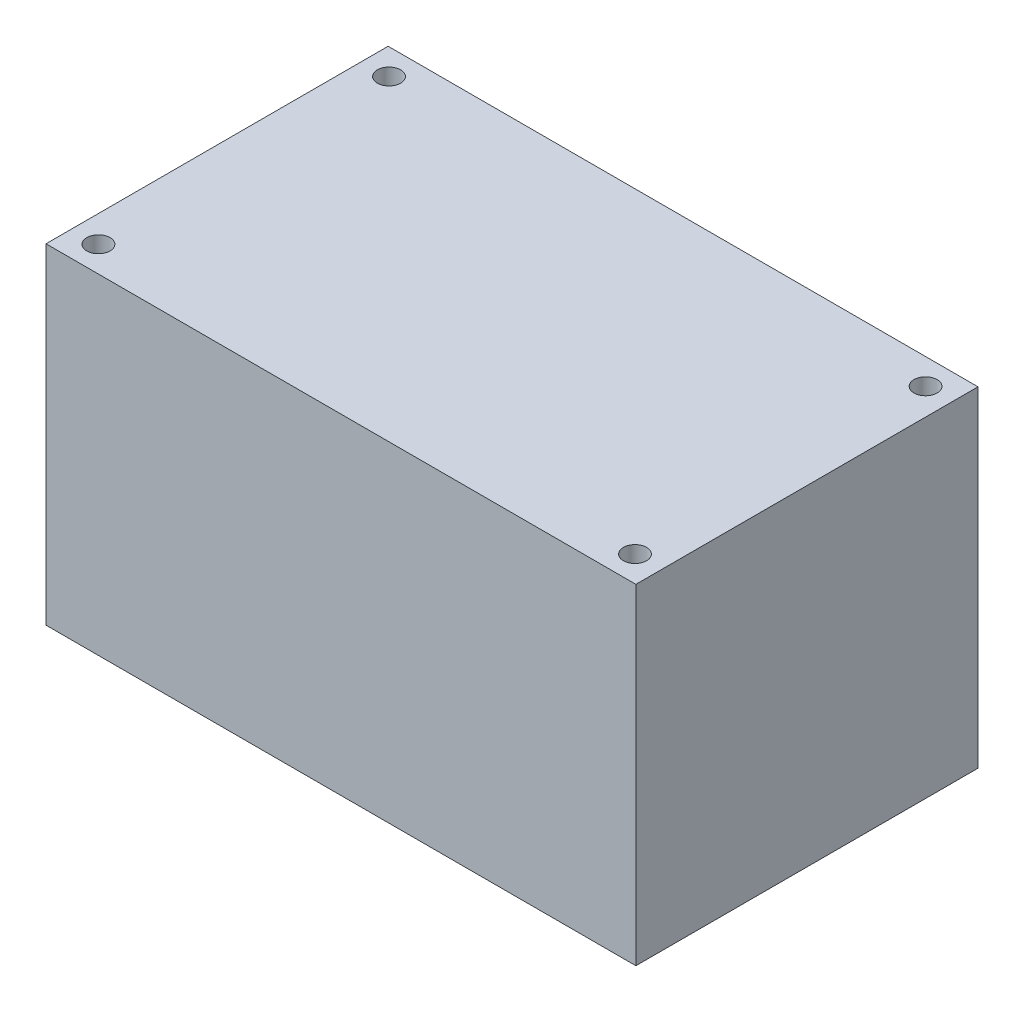
ISO-10303-21;
HEADER;
FILE_DESCRIPTION(('STEP AP214'),'2;1');
FILE_NAME('part.step','',(''),(''),'','','');
FILE_SCHEMA(('AUTOMOTIVE_DESIGN { 1 0 10303 214 1 1 1 1 }'));
ENDSEC;
DATA;
#1=APPLICATION_CONTEXT('core data for automotive mechanical design processes');
#2=APPLICATION_PROTOCOL_DEFINITION('international standard','automotive_design',2000,#1);
#3=PRODUCT_CONTEXT('',#1,'mechanical');
#4=PRODUCT('Part','Part','',(#3));
#5=PRODUCT_RELATED_PRODUCT_CATEGORY('part','',(#4));
#6=PRODUCT_DEFINITION_FORMATION('','',#4);
#7=PRODUCT_DEFINITION_CONTEXT('part definition',#1,'design');
#8=PRODUCT_DEFINITION('design','',#6,#7);
#9=PRODUCT_DEFINITION_SHAPE('','',#8);
#10=(LENGTH_UNIT() NAMED_UNIT(*) SI_UNIT(.MILLI.,.METRE.));
#11=(NAMED_UNIT(*) PLANE_ANGLE_UNIT() SI_UNIT($,.RADIAN.));
#12=(NAMED_UNIT(*) SI_UNIT($,.STERADIAN.) SOLID_ANGLE_UNIT());
#13=UNCERTAINTY_MEASURE_WITH_UNIT(LENGTH_MEASURE(1.E-05),#10,'distance_accuracy_value','');
#14=(GEOMETRIC_REPRESENTATION_CONTEXT(3) GLOBAL_UNCERTAINTY_ASSIGNED_CONTEXT((#13)) GLOBAL_UNIT_ASSIGNED_CONTEXT((#10,
#11,#12)) REPRESENTATION_CONTEXT('',''));
#15=CARTESIAN_POINT('',(0.,0.,0.));
#16=DIRECTION('',(0.,0.,1.));
#17=DIRECTION('',(1.,0.,0.));
#18=AXIS2_PLACEMENT_3D('',#15,#16,#17);
#19=CARTESIAN_POINT('',(31.75,17.78,-18.415));
#20=DIRECTION('',(-1.,0.,0.));
#21=DIRECTION('',(0.,0.,1.));
#22=AXIS2_PLACEMENT_3D('',#19,#20,#21);
#23=PLANE('',#22);
#24=DIRECTION('',(0.,0.,-1.));
#25=VECTOR('',#24,1.);
#26=CARTESIAN_POINT('',(31.75,-17.78,-18.415));
#27=LINE('',#26,#25);
#28=CARTESIAN_POINT('',(31.75,-17.78,18.415));
#29=VERTEX_POINT('',#28);
#30=CARTESIAN_POINT('',(31.75,-17.78,-18.415));
#31=VERTEX_POINT('',#30);
#32=EDGE_CURVE('E102',#29,#31,#27,.T.);
#33=ORIENTED_EDGE('',*,*,#32,.T.);
#34=DIRECTION('',(0.,-1.,0.));
#35=VECTOR('',#34,1.);
#36=CARTESIAN_POINT('',(31.75,17.78,-18.415));
#37=LINE('',#36,#35);
#38=CARTESIAN_POINT('',(31.75,17.78,-18.415));
#39=VERTEX_POINT('',#38);
#40=EDGE_CURVE('E11',#39,#31,#37,.T.);
#41=ORIENTED_EDGE('',*,*,#40,.F.);
#42=DIRECTION('',(0.,0.,-1.));
#43=VECTOR('',#42,1.);
#44=CARTESIAN_POINT('',(31.75,17.78,-18.415));
#45=LINE('',#44,#43);
#46=CARTESIAN_POINT('',(31.75,17.78,18.415));
#47=VERTEX_POINT('',#46);
#48=EDGE_CURVE('E90',#47,#39,#45,.T.);
#49=ORIENTED_EDGE('',*,*,#48,.F.);
#50=DIRECTION('',(0.,-1.,0.));
#51=VECTOR('',#50,1.);
#52=CARTESIAN_POINT('',(31.75,17.78,18.415));
#53=LINE('',#52,#51);
#54=EDGE_CURVE('E98',#47,#29,#53,.T.);
#55=ORIENTED_EDGE('',*,*,#54,.T.);
#56=EDGE_LOOP('',(#33,#41,#49,#55));
#57=FACE_BOUND('',#56,.T.);
#58=ADVANCED_FACE('F39',(#57),#23,.F.);
#59=CARTESIAN_POINT('',(-31.75,17.78,-18.415));
#60=DIRECTION('',(0.,0.,1.));
#61=DIRECTION('',(1.,0.,0.));
#62=AXIS2_PLACEMENT_3D('',#59,#60,#61);
#63=PLANE('',#62);
#64=DIRECTION('',(-1.,0.,0.));
#65=VECTOR('',#64,1.);
#66=CARTESIAN_POINT('',(-31.75,-17.78,-18.415));
#67=LINE('',#66,#65);
#68=CARTESIAN_POINT('',(-31.75,-17.78,-18.415));
#69=VERTEX_POINT('',#68);
#70=EDGE_CURVE('E94',#31,#69,#67,.T.);
#71=ORIENTED_EDGE('',*,*,#70,.T.);
#72=DIRECTION('',(0.,-1.,0.));
#73=VECTOR('',#72,1.);
#74=CARTESIAN_POINT('',(-31.75,17.78,-18.415));
#75=LINE('',#74,#73);
#76=CARTESIAN_POINT('',(-31.75,17.78,-18.415));
#77=VERTEX_POINT('',#76);
#78=EDGE_CURVE('E47',#77,#69,#75,.T.);
#79=ORIENTED_EDGE('',*,*,#78,.F.);
#80=DIRECTION('',(-1.,0.,0.));
#81=VECTOR('',#80,1.);
#82=CARTESIAN_POINT('',(-31.75,17.78,-18.415));
#83=LINE('',#82,#81);
#84=EDGE_CURVE('E85',#39,#77,#83,.T.);
#85=ORIENTED_EDGE('',*,*,#84,.F.);
#86=ORIENTED_EDGE('',*,*,#40,.T.);
#87=EDGE_LOOP('',(#71,#79,#85,#86));
#88=FACE_BOUND('',#87,.T.);
#89=ADVANCED_FACE('F93',(#88),#63,.F.);
#90=CARTESIAN_POINT('',(-31.75,17.78,-18.415));
#91=DIRECTION('',(1.,0.,0.));
#92=DIRECTION('',(0.,0.,-1.));
#93=AXIS2_PLACEMENT_3D('',#90,#91,#92);
#94=PLANE('',#93);
#95=DIRECTION('',(0.,0.,1.));
#96=VECTOR('',#95,1.);
#97=CARTESIAN_POINT('',(-31.75,-17.78,-18.415));
#98=LINE('',#97,#96);
#99=CARTESIAN_POINT('',(-31.75,-17.78,18.415));
#100=VERTEX_POINT('',#99);
#101=EDGE_CURVE('E72',#69,#100,#98,.T.);
#102=ORIENTED_EDGE('',*,*,#101,.T.);
#103=DIRECTION('',(0.,-1.,0.));
#104=VECTOR('',#103,1.);
#105=CARTESIAN_POINT('',(-31.75,17.78,18.415));
#106=LINE('',#105,#104);
#107=CARTESIAN_POINT('',(-31.75,17.78,18.415));
#108=VERTEX_POINT('',#107);
#109=EDGE_CURVE('E95',#108,#100,#106,.T.);
#110=ORIENTED_EDGE('',*,*,#109,.F.);
#111=DIRECTION('',(0.,0.,1.));
#112=VECTOR('',#111,1.);
#113=CARTESIAN_POINT('',(-31.75,17.78,-18.415));
#114=LINE('',#113,#112);
#115=EDGE_CURVE('E88',#77,#108,#114,.T.);
#116=ORIENTED_EDGE('',*,*,#115,.F.);
#117=ORIENTED_EDGE('',*,*,#78,.T.);
#118=EDGE_LOOP('',(#102,#110,#116,#117));
#119=FACE_BOUND('',#118,.T.);
#120=ADVANCED_FACE('F96',(#119),#94,.F.);
#121=CARTESIAN_POINT('',(-31.75,17.78,18.415));
#122=DIRECTION('',(0.,0.,-1.));
#123=DIRECTION('',(-1.,0.,0.));
#124=AXIS2_PLACEMENT_3D('',#121,#122,#123);
#125=PLANE('',#124);
#126=DIRECTION('',(1.,0.,0.));
#127=VECTOR('',#126,1.);
#128=CARTESIAN_POINT('',(-31.75,-17.78,18.415));
#129=LINE('',#128,#127);
#130=EDGE_CURVE('E78',#100,#29,#129,.T.);
#131=ORIENTED_EDGE('',*,*,#130,.T.);
#132=ORIENTED_EDGE('',*,*,#54,.F.);
#133=DIRECTION('',(1.,0.,0.));
#134=VECTOR('',#133,1.);
#135=CARTESIAN_POINT('',(-31.75,17.78,18.415));
#136=LINE('',#135,#134);
#137=EDGE_CURVE('E55',#108,#47,#136,.T.);
#138=ORIENTED_EDGE('',*,*,#137,.F.);
#139=ORIENTED_EDGE('',*,*,#109,.T.);
#140=EDGE_LOOP('',(#131,#132,#138,#139));
#141=FACE_BOUND('',#140,.T.);
#142=ADVANCED_FACE('F110',(#141),#125,.F.);
#143=CARTESIAN_POINT('',(0.,17.78,0.));
#144=DIRECTION('',(0.,1.,0.));
#145=DIRECTION('',(0.,0.,1.));
#146=AXIS2_PLACEMENT_3D('',#143,#144,#145);
#147=PLANE('',#146);
#148=CARTESIAN_POINT('',(-28.88075,17.78,15.64005));
#149=DIRECTION('',(0.,1.,0.));
#150=DIRECTION('',(0.,0.,1.));
#151=AXIS2_PLACEMENT_3D('',#148,#149,#150);
#152=CIRCLE('',#151,1.25);
#153=CARTESIAN_POINT('',(-28.88075,17.78,16.89005));
#154=VERTEX_POINT('',#153);
#155=EDGE_CURVE('E105',#154,#154,#152,.T.);
#156=ORIENTED_EDGE('',*,*,#155,.F.);
#157=EDGE_LOOP('',(#156));
#158=FACE_BOUND('',#157,.T.);
#159=CARTESIAN_POINT('',(28.88075,17.78,15.64005));
#160=DIRECTION('',(0.,1.,0.));
#161=DIRECTION('',(0.,0.,1.));
#162=AXIS2_PLACEMENT_3D('',#159,#160,#161);
#163=CIRCLE('',#162,1.25);
#164=CARTESIAN_POINT('',(28.88075,17.78,16.89005));
#165=VERTEX_POINT('',#164);
#166=EDGE_CURVE('E118',#165,#165,#163,.T.);
#167=ORIENTED_EDGE('',*,*,#166,.F.);
#168=EDGE_LOOP('',(#167));
#169=FACE_BOUND('',#168,.T.);
#170=CARTESIAN_POINT('',(28.88075,17.78,-15.64005));
#171=DIRECTION('',(0.,1.,0.));
#172=DIRECTION('',(0.,0.,1.));
#173=AXIS2_PLACEMENT_3D('',#170,#171,#172);
#174=CIRCLE('',#173,1.25);
#175=CARTESIAN_POINT('',(28.88075,17.78,-14.39005));
#176=VERTEX_POINT('',#175);
#177=EDGE_CURVE('E121',#176,#176,#174,.T.);
#178=ORIENTED_EDGE('',*,*,#177,.F.);
#179=EDGE_LOOP('',(#178));
#180=FACE_BOUND('',#179,.T.);
#181=CARTESIAN_POINT('',(-28.88075,17.78,-15.64005));
#182=DIRECTION('',(0.,1.,0.));
#183=DIRECTION('',(0.,0.,1.));
#184=AXIS2_PLACEMENT_3D('',#181,#182,#183);
#185=CIRCLE('',#184,1.25);
#186=CARTESIAN_POINT('',(-28.88075,17.78,-14.39005));
#187=VERTEX_POINT('',#186);
#188=EDGE_CURVE('E124',#187,#187,#185,.T.);
#189=ORIENTED_EDGE('',*,*,#188,.F.);
#190=EDGE_LOOP('',(#189));
#191=FACE_BOUND('',#190,.T.);
#192=ORIENTED_EDGE('',*,*,#48,.T.);
#193=ORIENTED_EDGE('',*,*,#84,.T.);
#194=ORIENTED_EDGE('',*,*,#115,.T.);
#195=ORIENTED_EDGE('',*,*,#137,.T.);
#196=EDGE_LOOP('',(#192,#193,#194,#195));
#197=FACE_BOUND('',#196,.T.);
#198=ADVANCED_FACE('F86',(#158,#169,#180,#191,#197),#147,.T.);
#199=CARTESIAN_POINT('',(0.,-17.78,0.));
#200=DIRECTION('',(0.,1.,0.));
#201=DIRECTION('',(0.,0.,1.));
#202=AXIS2_PLACEMENT_3D('',#199,#200,#201);
#203=PLANE('',#202);
#204=CARTESIAN_POINT('',(-28.88075,-17.78,15.64005));
#205=DIRECTION('',(0.,1.,0.));
#206=DIRECTION('',(0.,0.,1.));
#207=AXIS2_PLACEMENT_3D('',#204,#205,#206);
#208=CIRCLE('',#207,1.25);
#209=CARTESIAN_POINT('',(-28.88075,-17.78,16.89005));
#210=VERTEX_POINT('',#209);
#211=EDGE_CURVE('E131',#210,#210,#208,.T.);
#212=ORIENTED_EDGE('',*,*,#211,.T.);
#213=EDGE_LOOP('',(#212));
#214=FACE_BOUND('',#213,.T.);
#215=CARTESIAN_POINT('',(28.88075,-17.78,15.64005));
#216=DIRECTION('',(0.,1.,0.));
#217=DIRECTION('',(0.,0.,1.));
#218=AXIS2_PLACEMENT_3D('',#215,#216,#217);
#219=CIRCLE('',#218,1.25);
#220=CARTESIAN_POINT('',(28.88075,-17.78,16.89005));
#221=VERTEX_POINT('',#220);
#222=EDGE_CURVE('E134',#221,#221,#219,.T.);
#223=ORIENTED_EDGE('',*,*,#222,.T.);
#224=EDGE_LOOP('',(#223));
#225=FACE_BOUND('',#224,.T.);
#226=CARTESIAN_POINT('',(28.88075,-17.78,-15.64005));
#227=DIRECTION('',(0.,1.,0.));
#228=DIRECTION('',(0.,0.,1.));
#229=AXIS2_PLACEMENT_3D('',#226,#227,#228);
#230=CIRCLE('',#229,1.25);
#231=CARTESIAN_POINT('',(28.88075,-17.78,-14.39005));
#232=VERTEX_POINT('',#231);
#233=EDGE_CURVE('E130',#232,#232,#230,.T.);
#234=ORIENTED_EDGE('',*,*,#233,.T.);
#235=EDGE_LOOP('',(#234));
#236=FACE_BOUND('',#235,.T.);
#237=CARTESIAN_POINT('',(-28.88075,-17.78,-15.64005));
#238=DIRECTION('',(0.,1.,0.));
#239=DIRECTION('',(0.,0.,1.));
#240=AXIS2_PLACEMENT_3D('',#237,#238,#239);
#241=CIRCLE('',#240,1.25);
#242=CARTESIAN_POINT('',(-28.88075,-17.78,-14.39005));
#243=VERTEX_POINT('',#242);
#244=EDGE_CURVE('E127',#243,#243,#241,.T.);
#245=ORIENTED_EDGE('',*,*,#244,.T.);
#246=EDGE_LOOP('',(#245));
#247=FACE_BOUND('',#246,.T.);
#248=ORIENTED_EDGE('',*,*,#32,.F.);
#249=ORIENTED_EDGE('',*,*,#130,.F.);
#250=ORIENTED_EDGE('',*,*,#101,.F.);
#251=ORIENTED_EDGE('',*,*,#70,.F.);
#252=EDGE_LOOP('',(#248,#249,#250,#251));
#253=FACE_BOUND('',#252,.T.);
#254=ADVANCED_FACE('F113',(#214,#225,#236,#247,#253),#203,.F.);
#255=CARTESIAN_POINT('',(-28.88075,-17.78,-15.64005));
#256=DIRECTION('',(0.,1.,0.));
#257=DIRECTION('',(0.,0.,1.));
#258=AXIS2_PLACEMENT_3D('',#255,#256,#257);
#259=CYLINDRICAL_SURFACE('',#258,1.25);
#260=ORIENTED_EDGE('',*,*,#188,.T.);
#261=EDGE_LOOP('',(#260));
#262=FACE_BOUND('',#261,.T.);
#263=ORIENTED_EDGE('',*,*,#244,.F.);
#264=EDGE_LOOP('',(#263));
#265=FACE_BOUND('',#264,.T.);
#266=ADVANCED_FACE('F145',(#262,#265),#259,.F.);
#267=CARTESIAN_POINT('',(28.88075,-17.78,-15.64005));
#268=DIRECTION('',(0.,1.,0.));
#269=DIRECTION('',(0.,0.,1.));
#270=AXIS2_PLACEMENT_3D('',#267,#268,#269);
#271=CYLINDRICAL_SURFACE('',#270,1.25);
#272=ORIENTED_EDGE('',*,*,#177,.T.);
#273=EDGE_LOOP('',(#272));
#274=FACE_BOUND('',#273,.T.);
#275=ORIENTED_EDGE('',*,*,#233,.F.);
#276=EDGE_LOOP('',(#275));
#277=FACE_BOUND('',#276,.T.);
#278=ADVANCED_FACE('F142',(#274,#277),#271,.F.);
#279=CARTESIAN_POINT('',(28.88075,-17.78,15.64005));
#280=DIRECTION('',(0.,1.,0.));
#281=DIRECTION('',(0.,0.,1.));
#282=AXIS2_PLACEMENT_3D('',#279,#280,#281);
#283=CYLINDRICAL_SURFACE('',#282,1.25);
#284=ORIENTED_EDGE('',*,*,#166,.T.);
#285=EDGE_LOOP('',(#284));
#286=FACE_BOUND('',#285,.T.);
#287=ORIENTED_EDGE('',*,*,#222,.F.);
#288=EDGE_LOOP('',(#287));
#289=FACE_BOUND('',#288,.T.);
#290=ADVANCED_FACE('F144',(#286,#289),#283,.F.);
#291=CARTESIAN_POINT('',(-28.88075,-17.78,15.64005));
#292=DIRECTION('',(0.,1.,0.));
#293=DIRECTION('',(0.,0.,1.));
#294=AXIS2_PLACEMENT_3D('',#291,#292,#293);
#295=CYLINDRICAL_SURFACE('',#294,1.25);
#296=ORIENTED_EDGE('',*,*,#155,.T.);
#297=EDGE_LOOP('',(#296));
#298=FACE_BOUND('',#297,.T.);
#299=ORIENTED_EDGE('',*,*,#211,.F.);
#300=EDGE_LOOP('',(#299));
#301=FACE_BOUND('',#300,.T.);
#302=ADVANCED_FACE('F152',(#298,#301),#295,.F.);
#303=CLOSED_SHELL('',(#58,#89,#120,#142,#198,#254,#266,#278,#290,#302));
#304=MANIFOLD_SOLID_BREP('B2',#303);
#305=ADVANCED_BREP_SHAPE_REPRESENTATION('',(#18,#304),#14);
#306=SHAPE_DEFINITION_REPRESENTATION(#9,#305);
ENDSEC;
END-ISO-10303-21;
